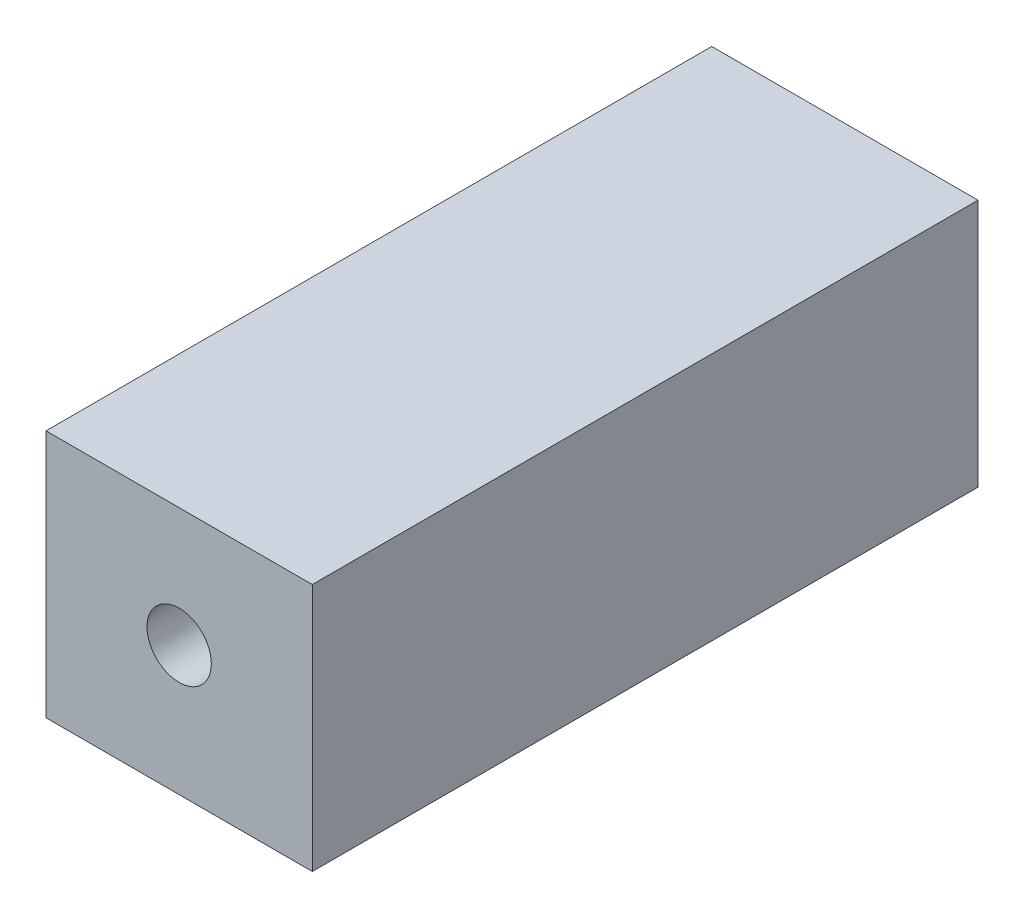
ISO-10303-21;
HEADER;
FILE_DESCRIPTION(('STEP AP214'),'2;1');
FILE_NAME('part.step','',(''),(''),'','','');
FILE_SCHEMA(('AUTOMOTIVE_DESIGN { 1 0 10303 214 1 1 1 1 }'));
ENDSEC;
DATA;
#1=APPLICATION_CONTEXT('core data for automotive mechanical design processes');
#2=APPLICATION_PROTOCOL_DEFINITION('international standard','automotive_design',2000,#1);
#3=PRODUCT_CONTEXT('',#1,'mechanical');
#4=PRODUCT('Part','Part','',(#3));
#5=PRODUCT_RELATED_PRODUCT_CATEGORY('part','',(#4));
#6=PRODUCT_DEFINITION_FORMATION('','',#4);
#7=PRODUCT_DEFINITION_CONTEXT('part definition',#1,'design');
#8=PRODUCT_DEFINITION('design','',#6,#7);
#9=PRODUCT_DEFINITION_SHAPE('','',#8);
#10=(LENGTH_UNIT() NAMED_UNIT(*) SI_UNIT(.MILLI.,.METRE.));
#11=(NAMED_UNIT(*) PLANE_ANGLE_UNIT() SI_UNIT($,.RADIAN.));
#12=(NAMED_UNIT(*) SI_UNIT($,.STERADIAN.) SOLID_ANGLE_UNIT());
#13=UNCERTAINTY_MEASURE_WITH_UNIT(LENGTH_MEASURE(1.E-05),#10,'distance_accuracy_value','');
#14=(GEOMETRIC_REPRESENTATION_CONTEXT(3) GLOBAL_UNCERTAINTY_ASSIGNED_CONTEXT((#13)) GLOBAL_UNIT_ASSIGNED_CONTEXT((#10,
#11,#12)) REPRESENTATION_CONTEXT('',''));
#15=CARTESIAN_POINT('',(0.,0.,0.));
#16=DIRECTION('',(0.,0.,1.));
#17=DIRECTION('',(1.,0.,0.));
#18=AXIS2_PLACEMENT_3D('',#15,#16,#17);
#19=CARTESIAN_POINT('',(0.,0.,30.));
#20=DIRECTION('',(0.,0.,1.));
#21=DIRECTION('',(1.,0.,0.));
#22=AXIS2_PLACEMENT_3D('',#19,#20,#21);
#23=PLANE('',#22);
#24=DIRECTION('',(0.,1.,0.));
#25=VECTOR('',#24,1.);
#26=CARTESIAN_POINT('',(6.,-5.83,30.));
#27=LINE('',#26,#25);
#28=CARTESIAN_POINT('',(6.,-5.83,30.));
#29=VERTEX_POINT('',#28);
#30=CARTESIAN_POINT('',(6.,5.37,30.));
#31=VERTEX_POINT('',#30);
#32=EDGE_CURVE('E96',#29,#31,#27,.T.);
#33=ORIENTED_EDGE('',*,*,#32,.T.);
#34=DIRECTION('',(-1.,0.,0.));
#35=VECTOR('',#34,1.);
#36=CARTESIAN_POINT('',(6.,5.37,30.));
#37=LINE('',#36,#35);
#38=CARTESIAN_POINT('',(-6.,5.37,30.));
#39=VERTEX_POINT('',#38);
#40=EDGE_CURVE('E91',#31,#39,#37,.T.);
#41=ORIENTED_EDGE('',*,*,#40,.T.);
#42=DIRECTION('',(0.,-1.,0.));
#43=VECTOR('',#42,1.);
#44=CARTESIAN_POINT('',(-6.,-5.83,30.));
#45=LINE('',#44,#43);
#46=CARTESIAN_POINT('',(-6.,-5.83,30.));
#47=VERTEX_POINT('',#46);
#48=EDGE_CURVE('E94',#39,#47,#45,.T.);
#49=ORIENTED_EDGE('',*,*,#48,.T.);
#50=DIRECTION('',(1.,0.,0.));
#51=VECTOR('',#50,1.);
#52=CARTESIAN_POINT('',(6.,-5.83,30.));
#53=LINE('',#52,#51);
#54=EDGE_CURVE('E61',#47,#29,#53,.T.);
#55=ORIENTED_EDGE('',*,*,#54,.T.);
#56=EDGE_LOOP('',(#33,#41,#49,#55));
#57=FACE_BOUND('',#56,.T.);
#58=CARTESIAN_POINT('',(0.,0.,30.));
#59=DIRECTION('',(0.,0.,1.));
#60=DIRECTION('',(1.,0.,0.));
#61=AXIS2_PLACEMENT_3D('',#58,#59,#60);
#62=CIRCLE('',#61,1.45);
#63=CARTESIAN_POINT('',(1.45,0.,30.));
#64=VERTEX_POINT('',#63);
#65=EDGE_CURVE('E116',#64,#64,#62,.T.);
#66=ORIENTED_EDGE('',*,*,#65,.F.);
#67=EDGE_LOOP('',(#66));
#68=FACE_BOUND('',#67,.T.);
#69=ADVANCED_FACE('F43',(#57,#68),#23,.T.);
#70=CARTESIAN_POINT('',(0.,0.,0.));
#71=DIRECTION('',(0.,0.,1.));
#72=DIRECTION('',(1.,0.,0.));
#73=AXIS2_PLACEMENT_3D('',#70,#71,#72);
#74=PLANE('',#73);
#75=DIRECTION('',(0.,1.,0.));
#76=VECTOR('',#75,1.);
#77=CARTESIAN_POINT('',(6.,-5.83,0.));
#78=LINE('',#77,#76);
#79=CARTESIAN_POINT('',(6.,-5.83,0.));
#80=VERTEX_POINT('',#79);
#81=CARTESIAN_POINT('',(6.,5.37,0.));
#82=VERTEX_POINT('',#81);
#83=EDGE_CURVE('E112',#80,#82,#78,.T.);
#84=ORIENTED_EDGE('',*,*,#83,.F.);
#85=DIRECTION('',(1.,0.,0.));
#86=VECTOR('',#85,1.);
#87=CARTESIAN_POINT('',(6.,-5.83,0.));
#88=LINE('',#87,#86);
#89=CARTESIAN_POINT('',(-6.,-5.83,0.));
#90=VERTEX_POINT('',#89);
#91=EDGE_CURVE('E84',#90,#80,#88,.T.);
#92=ORIENTED_EDGE('',*,*,#91,.F.);
#93=DIRECTION('',(0.,-1.,0.));
#94=VECTOR('',#93,1.);
#95=CARTESIAN_POINT('',(-6.,-5.83,0.));
#96=LINE('',#95,#94);
#97=CARTESIAN_POINT('',(-6.,5.37,0.));
#98=VERTEX_POINT('',#97);
#99=EDGE_CURVE('E78',#98,#90,#96,.T.);
#100=ORIENTED_EDGE('',*,*,#99,.F.);
#101=DIRECTION('',(-1.,0.,0.));
#102=VECTOR('',#101,1.);
#103=CARTESIAN_POINT('',(6.,5.37,0.));
#104=LINE('',#103,#102);
#105=EDGE_CURVE('E101',#82,#98,#104,.T.);
#106=ORIENTED_EDGE('',*,*,#105,.F.);
#107=EDGE_LOOP('',(#84,#92,#100,#106));
#108=FACE_BOUND('',#107,.T.);
#109=CARTESIAN_POINT('',(0.,0.,0.));
#110=DIRECTION('',(0.,0.,1.));
#111=DIRECTION('',(1.,0.,0.));
#112=AXIS2_PLACEMENT_3D('',#109,#110,#111);
#113=CIRCLE('',#112,1.45);
#114=CARTESIAN_POINT('',(1.45,0.,0.));
#115=VERTEX_POINT('',#114);
#116=EDGE_CURVE('E134',#115,#115,#113,.T.);
#117=ORIENTED_EDGE('',*,*,#116,.T.);
#118=EDGE_LOOP('',(#117));
#119=FACE_BOUND('',#118,.T.);
#120=ADVANCED_FACE('F129',(#108,#119),#74,.F.);
#121=CARTESIAN_POINT('',(6.,-5.83,30.));
#122=DIRECTION('',(-1.,0.,0.));
#123=DIRECTION('',(0.,0.,1.));
#124=AXIS2_PLACEMENT_3D('',#121,#122,#123);
#125=PLANE('',#124);
#126=ORIENTED_EDGE('',*,*,#83,.T.);
#127=DIRECTION('',(0.,0.,-1.));
#128=VECTOR('',#127,1.);
#129=CARTESIAN_POINT('',(6.,5.37,30.));
#130=LINE('',#129,#128);
#131=EDGE_CURVE('E11',#31,#82,#130,.T.);
#132=ORIENTED_EDGE('',*,*,#131,.F.);
#133=ORIENTED_EDGE('',*,*,#32,.F.);
#134=DIRECTION('',(0.,0.,-1.));
#135=VECTOR('',#134,1.);
#136=CARTESIAN_POINT('',(6.,-5.83,30.));
#137=LINE('',#136,#135);
#138=EDGE_CURVE('E108',#29,#80,#137,.T.);
#139=ORIENTED_EDGE('',*,*,#138,.T.);
#140=EDGE_LOOP('',(#126,#132,#133,#139));
#141=FACE_BOUND('',#140,.T.);
#142=ADVANCED_FACE('F45',(#141),#125,.F.);
#143=CARTESIAN_POINT('',(6.,5.37,30.));
#144=DIRECTION('',(0.,-1.,0.));
#145=DIRECTION('',(0.,0.,-1.));
#146=AXIS2_PLACEMENT_3D('',#143,#144,#145);
#147=PLANE('',#146);
#148=ORIENTED_EDGE('',*,*,#105,.T.);
#149=DIRECTION('',(0.,0.,-1.));
#150=VECTOR('',#149,1.);
#151=CARTESIAN_POINT('',(-6.,5.37,30.));
#152=LINE('',#151,#150);
#153=EDGE_CURVE('E53',#39,#98,#152,.T.);
#154=ORIENTED_EDGE('',*,*,#153,.F.);
#155=ORIENTED_EDGE('',*,*,#40,.F.);
#156=ORIENTED_EDGE('',*,*,#131,.T.);
#157=EDGE_LOOP('',(#148,#154,#155,#156));
#158=FACE_BOUND('',#157,.T.);
#159=ADVANCED_FACE('F100',(#158),#147,.F.);
#160=CARTESIAN_POINT('',(-6.,-5.83,30.));
#161=DIRECTION('',(1.,0.,0.));
#162=DIRECTION('',(0.,0.,-1.));
#163=AXIS2_PLACEMENT_3D('',#160,#161,#162);
#164=PLANE('',#163);
#165=ORIENTED_EDGE('',*,*,#99,.T.);
#166=DIRECTION('',(0.,0.,-1.));
#167=VECTOR('',#166,1.);
#168=CARTESIAN_POINT('',(-6.,-5.83,30.));
#169=LINE('',#168,#167);
#170=EDGE_CURVE('E103',#47,#90,#169,.T.);
#171=ORIENTED_EDGE('',*,*,#170,.F.);
#172=ORIENTED_EDGE('',*,*,#48,.F.);
#173=ORIENTED_EDGE('',*,*,#153,.T.);
#174=EDGE_LOOP('',(#165,#171,#172,#173));
#175=FACE_BOUND('',#174,.T.);
#176=ADVANCED_FACE('F104',(#175),#164,.F.);
#177=CARTESIAN_POINT('',(6.,-5.83,30.));
#178=DIRECTION('',(0.,1.,0.));
#179=DIRECTION('',(0.,0.,1.));
#180=AXIS2_PLACEMENT_3D('',#177,#178,#179);
#181=PLANE('',#180);
#182=ORIENTED_EDGE('',*,*,#91,.T.);
#183=ORIENTED_EDGE('',*,*,#138,.F.);
#184=ORIENTED_EDGE('',*,*,#54,.F.);
#185=ORIENTED_EDGE('',*,*,#170,.T.);
#186=EDGE_LOOP('',(#182,#183,#184,#185));
#187=FACE_BOUND('',#186,.T.);
#188=ADVANCED_FACE('F126',(#187),#181,.F.);
#189=CARTESIAN_POINT('',(0.,0.,30.));
#190=DIRECTION('',(0.,0.,-1.));
#191=DIRECTION('',(-1.,0.,0.));
#192=AXIS2_PLACEMENT_3D('',#189,#190,#191);
#193=CYLINDRICAL_SURFACE('',#192,1.45);
#194=ORIENTED_EDGE('',*,*,#65,.T.);
#195=EDGE_LOOP('',(#194));
#196=FACE_BOUND('',#195,.T.);
#197=ORIENTED_EDGE('',*,*,#116,.F.);
#198=EDGE_LOOP('',(#197));
#199=FACE_BOUND('',#198,.T.);
#200=ADVANCED_FACE('F142',(#196,#199),#193,.F.);
#201=CLOSED_SHELL('',(#69,#120,#142,#159,#176,#188,#200));
#202=MANIFOLD_SOLID_BREP('B2',#201);
#203=ADVANCED_BREP_SHAPE_REPRESENTATION('',(#18,#202),#14);
#204=SHAPE_DEFINITION_REPRESENTATION(#9,#203);
ENDSEC;
END-ISO-10303-21;
